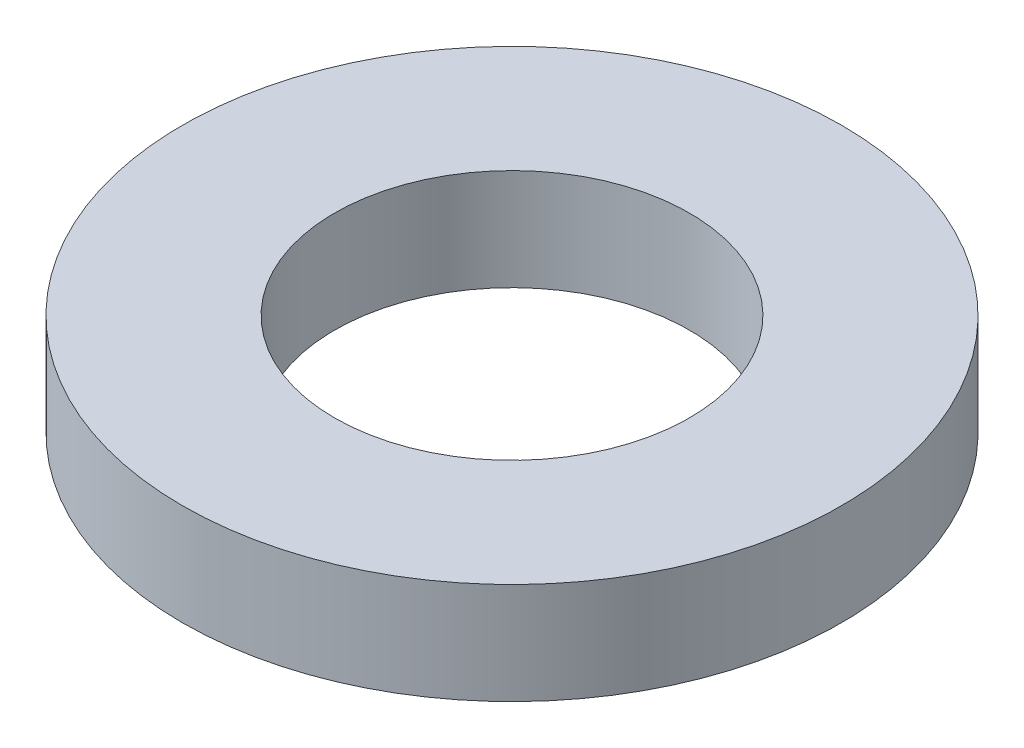
ISO-10303-21;
HEADER;
FILE_DESCRIPTION(('STEP AP214'),'2;1');
FILE_NAME('part.step','',(''),(''),'','','');
FILE_SCHEMA(('AUTOMOTIVE_DESIGN { 1 0 10303 214 1 1 1 1 }'));
ENDSEC;
DATA;
#1=APPLICATION_CONTEXT('core data for automotive mechanical design processes');
#2=APPLICATION_PROTOCOL_DEFINITION('international standard','automotive_design',2000,#1);
#3=PRODUCT_CONTEXT('',#1,'mechanical');
#4=PRODUCT('Part','Part','',(#3));
#5=PRODUCT_RELATED_PRODUCT_CATEGORY('part','',(#4));
#6=PRODUCT_DEFINITION_FORMATION('','',#4);
#7=PRODUCT_DEFINITION_CONTEXT('part definition',#1,'design');
#8=PRODUCT_DEFINITION('design','',#6,#7);
#9=PRODUCT_DEFINITION_SHAPE('','',#8);
#10=(LENGTH_UNIT() NAMED_UNIT(*) SI_UNIT(.MILLI.,.METRE.));
#11=(NAMED_UNIT(*) PLANE_ANGLE_UNIT() SI_UNIT($,.RADIAN.));
#12=(NAMED_UNIT(*) SI_UNIT($,.STERADIAN.) SOLID_ANGLE_UNIT());
#13=UNCERTAINTY_MEASURE_WITH_UNIT(LENGTH_MEASURE(1.E-05),#10,'distance_accuracy_value','');
#14=(GEOMETRIC_REPRESENTATION_CONTEXT(3) GLOBAL_UNCERTAINTY_ASSIGNED_CONTEXT((#13)) GLOBAL_UNIT_ASSIGNED_CONTEXT((#10,
#11,#12)) REPRESENTATION_CONTEXT('',''));
#15=CARTESIAN_POINT('',(0.,0.,0.));
#16=DIRECTION('',(0.,0.,1.));
#17=DIRECTION('',(1.,0.,0.));
#18=AXIS2_PLACEMENT_3D('',#15,#16,#17);
#19=CARTESIAN_POINT('',(0.,1.,0.));
#20=DIRECTION('',(0.,1.,0.));
#21=DIRECTION('',(0.,0.,1.));
#22=AXIS2_PLACEMENT_3D('',#19,#20,#21);
#23=PLANE('',#22);
#24=CARTESIAN_POINT('',(0.,1.,0.));
#25=DIRECTION('',(0.,1.,0.));
#26=DIRECTION('',(0.,0.,1.));
#27=AXIS2_PLACEMENT_3D('',#24,#25,#26);
#28=CIRCLE('',#27,3.25);
#29=CARTESIAN_POINT('',(0.,1.,3.25));
#30=VERTEX_POINT('',#29);
#31=EDGE_CURVE('E10',#30,#30,#28,.T.);
#32=ORIENTED_EDGE('',*,*,#31,.T.);
#33=EDGE_LOOP('',(#32));
#34=FACE_BOUND('',#33,.T.);
#35=CARTESIAN_POINT('',(0.,1.,0.));
#36=DIRECTION('',(0.,1.,0.));
#37=DIRECTION('',(0.,0.,1.));
#38=AXIS2_PLACEMENT_3D('',#35,#36,#37);
#39=CIRCLE('',#38,1.75);
#40=CARTESIAN_POINT('',(0.,1.,1.75));
#41=VERTEX_POINT('',#40);
#42=EDGE_CURVE('E42',#41,#41,#39,.T.);
#43=ORIENTED_EDGE('',*,*,#42,.F.);
#44=EDGE_LOOP('',(#43));
#45=FACE_BOUND('',#44,.T.);
#46=ADVANCED_FACE('F31',(#34,#45),#23,.T.);
#47=CARTESIAN_POINT('',(0.,0.,0.));
#48=DIRECTION('',(0.,1.,0.));
#49=DIRECTION('',(0.,0.,1.));
#50=AXIS2_PLACEMENT_3D('',#47,#48,#49);
#51=PLANE('',#50);
#52=CARTESIAN_POINT('',(0.,0.,0.));
#53=DIRECTION('',(0.,1.,0.));
#54=DIRECTION('',(0.,0.,1.));
#55=AXIS2_PLACEMENT_3D('',#52,#53,#54);
#56=CIRCLE('',#55,3.25);
#57=CARTESIAN_POINT('',(0.,0.,3.25));
#58=VERTEX_POINT('',#57);
#59=EDGE_CURVE('E35',#58,#58,#56,.T.);
#60=ORIENTED_EDGE('',*,*,#59,.F.);
#61=EDGE_LOOP('',(#60));
#62=FACE_BOUND('',#61,.T.);
#63=CARTESIAN_POINT('',(0.,0.,0.));
#64=DIRECTION('',(0.,1.,0.));
#65=DIRECTION('',(0.,0.,1.));
#66=AXIS2_PLACEMENT_3D('',#63,#64,#65);
#67=CIRCLE('',#66,1.75);
#68=CARTESIAN_POINT('',(0.,0.,1.75));
#69=VERTEX_POINT('',#68);
#70=EDGE_CURVE('E44',#69,#69,#67,.T.);
#71=ORIENTED_EDGE('',*,*,#70,.T.);
#72=EDGE_LOOP('',(#71));
#73=FACE_BOUND('',#72,.T.);
#74=ADVANCED_FACE('F54',(#62,#73),#51,.F.);
#75=CARTESIAN_POINT('',(0.,1.,0.));
#76=DIRECTION('',(0.,-1.,0.));
#77=DIRECTION('',(0.,0.,-1.));
#78=AXIS2_PLACEMENT_3D('',#75,#76,#77);
#79=CYLINDRICAL_SURFACE('',#78,3.25);
#80=ORIENTED_EDGE('',*,*,#31,.F.);
#81=EDGE_LOOP('',(#80));
#82=FACE_BOUND('',#81,.T.);
#83=ORIENTED_EDGE('',*,*,#59,.T.);
#84=EDGE_LOOP('',(#83));
#85=FACE_BOUND('',#84,.T.);
#86=ADVANCED_FACE('F33',(#82,#85),#79,.T.);
#87=CARTESIAN_POINT('',(0.,1.,0.));
#88=DIRECTION('',(0.,-1.,0.));
#89=DIRECTION('',(0.,0.,-1.));
#90=AXIS2_PLACEMENT_3D('',#87,#88,#89);
#91=CYLINDRICAL_SURFACE('',#90,1.75);
#92=ORIENTED_EDGE('',*,*,#42,.T.);
#93=EDGE_LOOP('',(#92));
#94=FACE_BOUND('',#93,.T.);
#95=ORIENTED_EDGE('',*,*,#70,.F.);
#96=EDGE_LOOP('',(#95));
#97=FACE_BOUND('',#96,.T.);
#98=ADVANCED_FACE('F50',(#94,#97),#91,.F.);
#99=CLOSED_SHELL('',(#46,#74,#86,#98));
#100=MANIFOLD_SOLID_BREP('B2',#99);
#101=ADVANCED_BREP_SHAPE_REPRESENTATION('',(#18,#100),#14);
#102=SHAPE_DEFINITION_REPRESENTATION(#9,#101);
ENDSEC;
END-ISO-10303-21;
